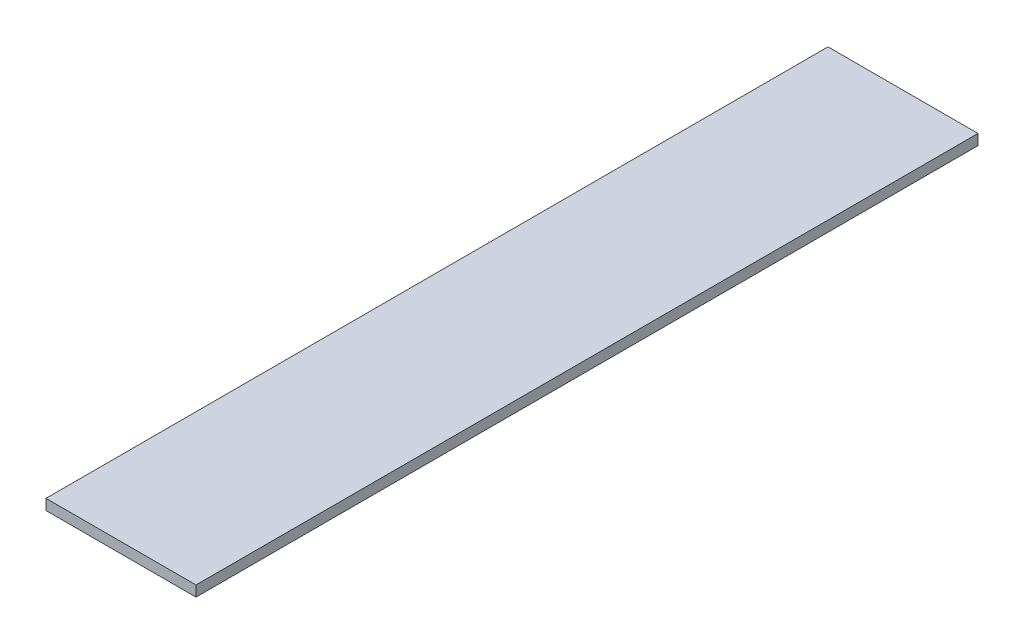
ISO-10303-21;
HEADER;
FILE_DESCRIPTION(('STEP AP214'),'2;1');
FILE_NAME('part.step','',(''),(''),'','','');
FILE_SCHEMA(('AUTOMOTIVE_DESIGN { 1 0 10303 214 1 1 1 1 }'));
ENDSEC;
DATA;
#1=APPLICATION_CONTEXT('core data for automotive mechanical design processes');
#2=APPLICATION_PROTOCOL_DEFINITION('international standard','automotive_design',2000,#1);
#3=PRODUCT_CONTEXT('',#1,'mechanical');
#4=PRODUCT('Part','Part','',(#3));
#5=PRODUCT_RELATED_PRODUCT_CATEGORY('part','',(#4));
#6=PRODUCT_DEFINITION_FORMATION('','',#4);
#7=PRODUCT_DEFINITION_CONTEXT('part definition',#1,'design');
#8=PRODUCT_DEFINITION('design','',#6,#7);
#9=PRODUCT_DEFINITION_SHAPE('','',#8);
#10=(LENGTH_UNIT() NAMED_UNIT(*) SI_UNIT(.MILLI.,.METRE.));
#11=(NAMED_UNIT(*) PLANE_ANGLE_UNIT() SI_UNIT($,.RADIAN.));
#12=(NAMED_UNIT(*) SI_UNIT($,.STERADIAN.) SOLID_ANGLE_UNIT());
#13=UNCERTAINTY_MEASURE_WITH_UNIT(LENGTH_MEASURE(1.E-05),#10,'distance_accuracy_value','');
#14=(GEOMETRIC_REPRESENTATION_CONTEXT(3) GLOBAL_UNCERTAINTY_ASSIGNED_CONTEXT((#13)) GLOBAL_UNIT_ASSIGNED_CONTEXT((#10,
#11,#12)) REPRESENTATION_CONTEXT('',''));
#15=CARTESIAN_POINT('',(0.,0.,0.));
#16=DIRECTION('',(0.,0.,1.));
#17=DIRECTION('',(1.,0.,0.));
#18=AXIS2_PLACEMENT_3D('',#15,#16,#17);
#19=CARTESIAN_POINT('',(0.,6.35,0.));
#20=DIRECTION('',(1.,0.,0.));
#21=DIRECTION('',(0.,0.,-1.));
#22=AXIS2_PLACEMENT_3D('',#19,#20,#21);
#23=PLANE('',#22);
#24=DIRECTION('',(0.,0.,1.));
#25=VECTOR('',#24,1.);
#26=CARTESIAN_POINT('',(0.,0.,0.));
#27=LINE('',#26,#25);
#28=CARTESIAN_POINT('',(0.,0.,-469.2));
#29=VERTEX_POINT('',#28);
#30=CARTESIAN_POINT('',(0.,0.,0.));
#31=VERTEX_POINT('',#30);
#32=EDGE_CURVE('E96',#29,#31,#27,.T.);
#33=ORIENTED_EDGE('',*,*,#32,.T.);
#34=DIRECTION('',(0.,-1.,0.));
#35=VECTOR('',#34,1.);
#36=CARTESIAN_POINT('',(0.,6.35,0.));
#37=LINE('',#36,#35);
#38=CARTESIAN_POINT('',(0.,6.35,0.));
#39=VERTEX_POINT('',#38);
#40=EDGE_CURVE('E11',#39,#31,#37,.T.);
#41=ORIENTED_EDGE('',*,*,#40,.F.);
#42=DIRECTION('',(0.,0.,1.));
#43=VECTOR('',#42,1.);
#44=CARTESIAN_POINT('',(0.,6.35,0.));
#45=LINE('',#44,#43);
#46=CARTESIAN_POINT('',(0.,6.35,-469.2));
#47=VERTEX_POINT('',#46);
#48=EDGE_CURVE('E84',#47,#39,#45,.T.);
#49=ORIENTED_EDGE('',*,*,#48,.F.);
#50=DIRECTION('',(0.,-1.,0.));
#51=VECTOR('',#50,1.);
#52=CARTESIAN_POINT('',(0.,6.35,-469.2));
#53=LINE('',#52,#51);
#54=EDGE_CURVE('E92',#47,#29,#53,.T.);
#55=ORIENTED_EDGE('',*,*,#54,.T.);
#56=EDGE_LOOP('',(#33,#41,#49,#55));
#57=FACE_BOUND('',#56,.T.);
#58=ADVANCED_FACE('F33',(#57),#23,.F.);
#59=CARTESIAN_POINT('',(0.,6.35,0.));
#60=DIRECTION('',(0.,0.,-1.));
#61=DIRECTION('',(-1.,0.,0.));
#62=AXIS2_PLACEMENT_3D('',#59,#60,#61);
#63=PLANE('',#62);
#64=DIRECTION('',(1.,0.,0.));
#65=VECTOR('',#64,1.);
#66=CARTESIAN_POINT('',(0.,0.,0.));
#67=LINE('',#66,#65);
#68=CARTESIAN_POINT('',(90.,0.,0.));
#69=VERTEX_POINT('',#68);
#70=EDGE_CURVE('E88',#31,#69,#67,.T.);
#71=ORIENTED_EDGE('',*,*,#70,.T.);
#72=DIRECTION('',(0.,-1.,0.));
#73=VECTOR('',#72,1.);
#74=CARTESIAN_POINT('',(90.,6.35,0.));
#75=LINE('',#74,#73);
#76=CARTESIAN_POINT('',(90.,6.35,0.));
#77=VERTEX_POINT('',#76);
#78=EDGE_CURVE('E41',#77,#69,#75,.T.);
#79=ORIENTED_EDGE('',*,*,#78,.F.);
#80=DIRECTION('',(1.,0.,0.));
#81=VECTOR('',#80,1.);
#82=CARTESIAN_POINT('',(0.,6.35,0.));
#83=LINE('',#82,#81);
#84=EDGE_CURVE('E79',#39,#77,#83,.T.);
#85=ORIENTED_EDGE('',*,*,#84,.F.);
#86=ORIENTED_EDGE('',*,*,#40,.T.);
#87=EDGE_LOOP('',(#71,#79,#85,#86));
#88=FACE_BOUND('',#87,.T.);
#89=ADVANCED_FACE('F87',(#88),#63,.F.);
#90=CARTESIAN_POINT('',(90.,6.35,0.));
#91=DIRECTION('',(-1.,0.,0.));
#92=DIRECTION('',(0.,0.,1.));
#93=AXIS2_PLACEMENT_3D('',#90,#91,#92);
#94=PLANE('',#93);
#95=DIRECTION('',(0.,0.,-1.));
#96=VECTOR('',#95,1.);
#97=CARTESIAN_POINT('',(90.,0.,0.));
#98=LINE('',#97,#96);
#99=CARTESIAN_POINT('',(90.,0.,-469.2));
#100=VERTEX_POINT('',#99);
#101=EDGE_CURVE('E66',#69,#100,#98,.T.);
#102=ORIENTED_EDGE('',*,*,#101,.T.);
#103=DIRECTION('',(0.,-1.,0.));
#104=VECTOR('',#103,1.);
#105=CARTESIAN_POINT('',(90.,6.35,-469.2));
#106=LINE('',#105,#104);
#107=CARTESIAN_POINT('',(90.,6.35,-469.2));
#108=VERTEX_POINT('',#107);
#109=EDGE_CURVE('E89',#108,#100,#106,.T.);
#110=ORIENTED_EDGE('',*,*,#109,.F.);
#111=DIRECTION('',(0.,0.,-1.));
#112=VECTOR('',#111,1.);
#113=CARTESIAN_POINT('',(90.,6.35,0.));
#114=LINE('',#113,#112);
#115=EDGE_CURVE('E82',#77,#108,#114,.T.);
#116=ORIENTED_EDGE('',*,*,#115,.F.);
#117=ORIENTED_EDGE('',*,*,#78,.T.);
#118=EDGE_LOOP('',(#102,#110,#116,#117));
#119=FACE_BOUND('',#118,.T.);
#120=ADVANCED_FACE('F90',(#119),#94,.F.);
#121=CARTESIAN_POINT('',(0.,6.35,-469.2));
#122=DIRECTION('',(0.,0.,1.));
#123=DIRECTION('',(1.,0.,0.));
#124=AXIS2_PLACEMENT_3D('',#121,#122,#123);
#125=PLANE('',#124);
#126=DIRECTION('',(-1.,0.,0.));
#127=VECTOR('',#126,1.);
#128=CARTESIAN_POINT('',(0.,0.,-469.2));
#129=LINE('',#128,#127);
#130=EDGE_CURVE('E72',#100,#29,#129,.T.);
#131=ORIENTED_EDGE('',*,*,#130,.T.);
#132=ORIENTED_EDGE('',*,*,#54,.F.);
#133=DIRECTION('',(-1.,0.,0.));
#134=VECTOR('',#133,1.);
#135=CARTESIAN_POINT('',(0.,6.35,-469.2));
#136=LINE('',#135,#134);
#137=EDGE_CURVE('E49',#108,#47,#136,.T.);
#138=ORIENTED_EDGE('',*,*,#137,.F.);
#139=ORIENTED_EDGE('',*,*,#109,.T.);
#140=EDGE_LOOP('',(#131,#132,#138,#139));
#141=FACE_BOUND('',#140,.T.);
#142=ADVANCED_FACE('F103',(#141),#125,.F.);
#143=CARTESIAN_POINT('',(0.,6.35,0.));
#144=DIRECTION('',(0.,-1.,0.));
#145=DIRECTION('',(0.,0.,-1.));
#146=AXIS2_PLACEMENT_3D('',#143,#144,#145);
#147=PLANE('',#146);
#148=ORIENTED_EDGE('',*,*,#48,.T.);
#149=ORIENTED_EDGE('',*,*,#84,.T.);
#150=ORIENTED_EDGE('',*,*,#115,.T.);
#151=ORIENTED_EDGE('',*,*,#137,.T.);
#152=EDGE_LOOP('',(#148,#149,#150,#151));
#153=FACE_BOUND('',#152,.T.);
#154=ADVANCED_FACE('F80',(#153),#147,.F.);
#155=CARTESIAN_POINT('',(0.,0.,0.));
#156=DIRECTION('',(0.,-1.,0.));
#157=DIRECTION('',(0.,0.,-1.));
#158=AXIS2_PLACEMENT_3D('',#155,#156,#157);
#159=PLANE('',#158);
#160=ORIENTED_EDGE('',*,*,#32,.F.);
#161=ORIENTED_EDGE('',*,*,#130,.F.);
#162=ORIENTED_EDGE('',*,*,#101,.F.);
#163=ORIENTED_EDGE('',*,*,#70,.F.);
#164=EDGE_LOOP('',(#160,#161,#162,#163));
#165=FACE_BOUND('',#164,.T.);
#166=ADVANCED_FACE('F106',(#165),#159,.T.);
#167=CLOSED_SHELL('',(#58,#89,#120,#142,#154,#166));
#168=MANIFOLD_SOLID_BREP('B2',#167);
#169=ADVANCED_BREP_SHAPE_REPRESENTATION('',(#18,#168),#14);
#170=SHAPE_DEFINITION_REPRESENTATION(#9,#169);
ENDSEC;
END-ISO-10303-21;
